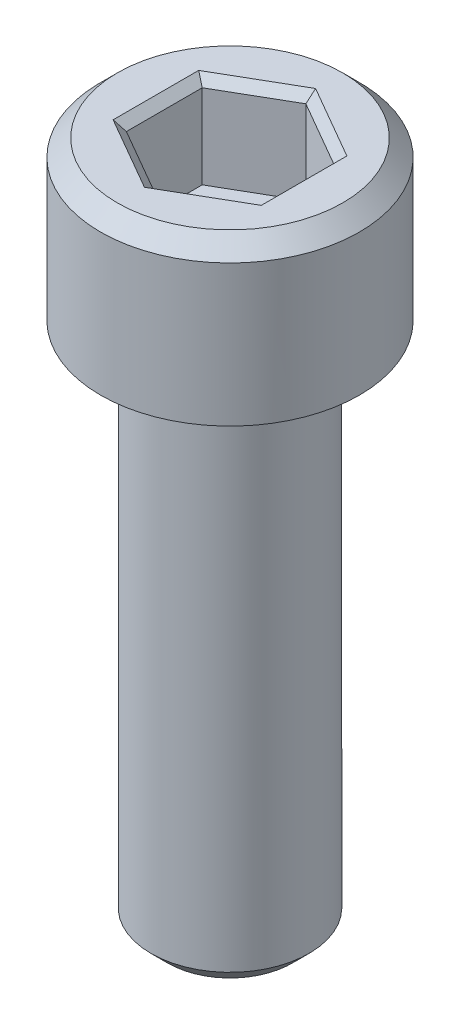
ISO-10303-21;
HEADER;
FILE_DESCRIPTION(('STEP AP214'),'2;1');
FILE_NAME('part.step','',(''),(''),'','','');
FILE_SCHEMA(('AUTOMOTIVE_DESIGN { 1 0 10303 214 1 1 1 1 }'));
ENDSEC;
DATA;
#1=APPLICATION_CONTEXT('core data for automotive mechanical design processes');
#2=APPLICATION_PROTOCOL_DEFINITION('international standard','automotive_design',2000,#1);
#3=PRODUCT_CONTEXT('',#1,'mechanical');
#4=PRODUCT('Part','Part','',(#3));
#5=PRODUCT_RELATED_PRODUCT_CATEGORY('part','',(#4));
#6=PRODUCT_DEFINITION_FORMATION('','',#4);
#7=PRODUCT_DEFINITION_CONTEXT('part definition',#1,'design');
#8=PRODUCT_DEFINITION('design','',#6,#7);
#9=PRODUCT_DEFINITION_SHAPE('','',#8);
#10=(LENGTH_UNIT() NAMED_UNIT(*) SI_UNIT(.MILLI.,.METRE.));
#11=(NAMED_UNIT(*) PLANE_ANGLE_UNIT() SI_UNIT($,.RADIAN.));
#12=(NAMED_UNIT(*) SI_UNIT($,.STERADIAN.) SOLID_ANGLE_UNIT());
#13=UNCERTAINTY_MEASURE_WITH_UNIT(LENGTH_MEASURE(1.E-05),#10,'distance_accuracy_value','');
#14=(GEOMETRIC_REPRESENTATION_CONTEXT(3) GLOBAL_UNCERTAINTY_ASSIGNED_CONTEXT((#13)) GLOBAL_UNIT_ASSIGNED_CONTEXT((#10,
#11,#12)) REPRESENTATION_CONTEXT('',''));
#15=CARTESIAN_POINT('',(0.,0.,0.));
#16=DIRECTION('',(0.,0.,1.));
#17=DIRECTION('',(1.,0.,0.));
#18=AXIS2_PLACEMENT_3D('',#15,#16,#17);
#19=CARTESIAN_POINT('',(0.,0.,0.));
#20=DIRECTION('',(0.,1.,0.));
#21=DIRECTION('',(0.,0.,1.));
#22=AXIS2_PLACEMENT_3D('',#19,#20,#21);
#23=PLANE('',#22);
#24=DIRECTION('',(0.,0.,1.));
#25=VECTOR('',#24,1.);
#26=CARTESIAN_POINT('',(2.23837500000001,0.,0.));
#27=LINE('',#26,#25);
#28=CARTESIAN_POINT('',(2.23837500000001,0.,-1.29232640879732));
#29=VERTEX_POINT('',#28);
#30=CARTESIAN_POINT('',(2.23837500000001,0.,1.29232640879733));
#31=VERTEX_POINT('',#30);
#32=EDGE_CURVE('E137',#29,#31,#27,.T.);
#33=ORIENTED_EDGE('',*,*,#32,.T.);
#34=DIRECTION('',(-0.866025403784439,0.,0.5));
#35=VECTOR('',#34,1.);
#36=CARTESIAN_POINT('',(1.11918750000001,0.,1.938489613196));
#37=LINE('',#36,#35);
#38=CARTESIAN_POINT('',(0.,0.,2.58465281759467));
#39=VERTEX_POINT('',#38);
#40=EDGE_CURVE('E139',#31,#39,#37,.T.);
#41=ORIENTED_EDGE('',*,*,#40,.T.);
#42=DIRECTION('',(-0.866025403784439,0.,-0.5));
#43=VECTOR('',#42,1.);
#44=CARTESIAN_POINT('',(-1.1191875,0.,1.938489613196));
#45=LINE('',#44,#43);
#46=CARTESIAN_POINT('',(-2.23837499999999,0.,1.29232640879733));
#47=VERTEX_POINT('',#46);
#48=EDGE_CURVE('E131',#39,#47,#45,.T.);
#49=ORIENTED_EDGE('',*,*,#48,.T.);
#50=DIRECTION('',(0.,0.,-1.));
#51=VECTOR('',#50,1.);
#52=CARTESIAN_POINT('',(-2.23837499999999,0.,0.));
#53=LINE('',#52,#51);
#54=CARTESIAN_POINT('',(-2.23837499999999,0.,-1.29232640879732));
#55=VERTEX_POINT('',#54);
#56=EDGE_CURVE('E129',#47,#55,#53,.T.);
#57=ORIENTED_EDGE('',*,*,#56,.T.);
#58=DIRECTION('',(0.866025403784438,0.,-0.5));
#59=VECTOR('',#58,1.);
#60=CARTESIAN_POINT('',(-1.11918749999999,0.,-1.93848961319599));
#61=LINE('',#60,#59);
#62=CARTESIAN_POINT('',(0.,0.,-2.58465281759465));
#63=VERTEX_POINT('',#62);
#64=EDGE_CURVE('E133',#55,#63,#61,.T.);
#65=ORIENTED_EDGE('',*,*,#64,.T.);
#66=DIRECTION('',(0.866025403784439,0.,0.5));
#67=VECTOR('',#66,1.);
#68=CARTESIAN_POINT('',(1.1191875,0.,-1.93848961319599));
#69=LINE('',#68,#67);
#70=EDGE_CURVE('E135',#63,#29,#69,.T.);
#71=ORIENTED_EDGE('',*,*,#70,.T.);
#72=EDGE_LOOP('',(#33,#41,#49,#57,#65,#71));
#73=FACE_BOUND('',#72,.T.);
#74=CARTESIAN_POINT('',(0.,0.,0.));
#75=DIRECTION('',(0.,1.,0.));
#76=DIRECTION('',(0.,0.,1.));
#77=AXIS2_PLACEMENT_3D('',#74,#75,#76);
#78=CIRCLE('',#77,3.4036);
#79=CARTESIAN_POINT('',(0.,0.,3.4036));
#80=VERTEX_POINT('',#79);
#81=EDGE_CURVE('E117',#80,#80,#78,.T.);
#82=ORIENTED_EDGE('',*,*,#81,.T.);
#83=EDGE_LOOP('',(#82));
#84=FACE_BOUND('',#83,.T.);
#85=ADVANCED_FACE('F14',(#73,#84),#23,.T.);
#86=CARTESIAN_POINT('',(0.,-4.77520000000009,0.));
#87=DIRECTION('',(0.,1.,0.));
#88=DIRECTION('',(0.,0.,1.));
#89=AXIS2_PLACEMENT_3D('',#86,#87,#88);
#90=CYLINDRICAL_SURFACE('',#89,3.9116);
#91=CARTESIAN_POINT('',(0.,-0.507999999999953,0.));
#92=DIRECTION('',(0.,1.,0.));
#93=DIRECTION('',(0.,0.,1.));
#94=AXIS2_PLACEMENT_3D('',#91,#92,#93);
#95=CIRCLE('',#94,3.9116);
#96=CARTESIAN_POINT('',(0.,-0.507999999999953,3.9116));
#97=VERTEX_POINT('',#96);
#98=EDGE_CURVE('E120',#97,#97,#95,.F.);
#99=ORIENTED_EDGE('',*,*,#98,.T.);
#100=EDGE_LOOP('',(#99));
#101=FACE_BOUND('',#100,.T.);
#102=CARTESIAN_POINT('',(0.,-4.77520000000009,0.));
#103=DIRECTION('',(0.,1.,0.));
#104=DIRECTION('',(1.,0.,0.));
#105=AXIS2_PLACEMENT_3D('',#102,#103,#104);
#106=CIRCLE('',#105,3.9116);
#107=CARTESIAN_POINT('',(3.9116,-4.77520000000009,0.));
#108=VERTEX_POINT('',#107);
#109=EDGE_CURVE('E109',#108,#108,#106,.T.);
#110=ORIENTED_EDGE('',*,*,#109,.T.);
#111=EDGE_LOOP('',(#110));
#112=FACE_BOUND('',#111,.T.);
#113=ADVANCED_FACE('F16',(#101,#112),#90,.T.);
#114=CARTESIAN_POINT('',(0.,-4.77520000000009,0.));
#115=DIRECTION('',(0.,1.,0.));
#116=DIRECTION('',(0.,0.,1.));
#117=AXIS2_PLACEMENT_3D('',#114,#115,#116);
#118=PLANE('',#117);
#119=CARTESIAN_POINT('',(0.,-4.77520000000009,0.));
#120=DIRECTION('',(0.,1.,0.));
#121=DIRECTION('',(1.,0.,0.));
#122=AXIS2_PLACEMENT_3D('',#119,#120,#121);
#123=CIRCLE('',#122,2.3876);
#124=CARTESIAN_POINT('',(2.3876,-4.77520000000009,0.));
#125=VERTEX_POINT('',#124);
#126=EDGE_CURVE('E104',#125,#125,#123,.T.);
#127=ORIENTED_EDGE('',*,*,#126,.T.);
#128=EDGE_LOOP('',(#127));
#129=FACE_BOUND('',#128,.T.);
#130=ORIENTED_EDGE('',*,*,#109,.F.);
#131=EDGE_LOOP('',(#130));
#132=FACE_BOUND('',#131,.T.);
#133=ADVANCED_FACE('F227',(#129,#132),#118,.F.);
#134=CARTESIAN_POINT('',(0.,-20.6502,0.));
#135=DIRECTION('',(0.,1.,0.));
#136=DIRECTION('',(0.,0.,1.));
#137=AXIS2_PLACEMENT_3D('',#134,#135,#136);
#138=CYLINDRICAL_SURFACE('',#137,2.3876);
#139=CARTESIAN_POINT('',(0.,-20.1422,0.));
#140=DIRECTION('',(0.,1.,0.));
#141=DIRECTION('',(0.,0.,1.));
#142=AXIS2_PLACEMENT_3D('',#139,#140,#141);
#143=CIRCLE('',#142,2.3876);
#144=CARTESIAN_POINT('',(0.,-20.1422,2.3876));
#145=VERTEX_POINT('',#144);
#146=EDGE_CURVE('E123',#145,#145,#143,.T.);
#147=ORIENTED_EDGE('',*,*,#146,.T.);
#148=EDGE_LOOP('',(#147));
#149=FACE_BOUND('',#148,.T.);
#150=ORIENTED_EDGE('',*,*,#126,.F.);
#151=EDGE_LOOP('',(#150));
#152=FACE_BOUND('',#151,.T.);
#153=ADVANCED_FACE('F230',(#149,#152),#138,.T.);
#154=CARTESIAN_POINT('',(0.,-20.6502,0.));
#155=DIRECTION('',(0.,1.,0.));
#156=DIRECTION('',(0.,0.,1.));
#157=AXIS2_PLACEMENT_3D('',#154,#155,#156);
#158=PLANE('',#157);
#159=CARTESIAN_POINT('',(0.,-20.6502,0.));
#160=DIRECTION('',(0.,1.,0.));
#161=DIRECTION('',(0.,0.,1.));
#162=AXIS2_PLACEMENT_3D('',#159,#160,#161);
#163=CIRCLE('',#162,1.8796);
#164=CARTESIAN_POINT('',(0.,-20.6502,1.8796));
#165=VERTEX_POINT('',#164);
#166=EDGE_CURVE('E126',#165,#165,#163,.F.);
#167=ORIENTED_EDGE('',*,*,#166,.T.);
#168=EDGE_LOOP('',(#167));
#169=FACE_BOUND('',#168,.T.);
#170=ADVANCED_FACE('F237',(#169),#158,.F.);
#171=CARTESIAN_POINT('',(0.,0.,0.));
#172=DIRECTION('',(0.,-1.,0.));
#173=DIRECTION('',(0.,0.,-1.));
#174=AXIS2_PLACEMENT_3D('',#171,#172,#173);
#175=CONICAL_SURFACE('',#174,3.4036,0.785398163397448);
#176=ORIENTED_EDGE('',*,*,#98,.F.);
#177=EDGE_LOOP('',(#176));
#178=FACE_BOUND('',#177,.T.);
#179=ORIENTED_EDGE('',*,*,#81,.F.);
#180=EDGE_LOOP('',(#179));
#181=FACE_BOUND('',#180,.T.);
#182=ADVANCED_FACE('F247',(#178,#181),#175,.T.);
#183=CARTESIAN_POINT('',(0.,-20.1422,0.));
#184=DIRECTION('',(0.,1.,0.));
#185=DIRECTION('',(0.,0.,1.));
#186=AXIS2_PLACEMENT_3D('',#183,#184,#185);
#187=CONICAL_SURFACE('',#186,2.3876,0.785398163397447);
#188=ORIENTED_EDGE('',*,*,#166,.F.);
#189=EDGE_LOOP('',(#188));
#190=FACE_BOUND('',#189,.T.);
#191=ORIENTED_EDGE('',*,*,#146,.F.);
#192=EDGE_LOOP('',(#191));
#193=FACE_BOUND('',#192,.T.);
#194=ADVANCED_FACE('F251',(#190,#193),#187,.T.);
#195=CARTESIAN_POINT('',(0.,-2.79399999999996,2.29135888084634));
#196=DIRECTION('',(0.5,0.,-0.866025403784438));
#197=DIRECTION('',(-0.866025403784438,0.,-0.5));
#198=AXIS2_PLACEMENT_3D('',#195,#196,#197);
#199=PLANE('',#198);
#200=DIRECTION('',(0.,1.,0.));
#201=VECTOR('',#200,1.);
#202=CARTESIAN_POINT('',(-1.984375,-2.79399999999996,1.14567944042317));
#203=LINE('',#202,#201);
#204=CARTESIAN_POINT('',(-1.984375,-2.79399999999996,1.14567944042317));
#205=VERTEX_POINT('',#204);
#206=CARTESIAN_POINT('',(-1.984375,-0.253999999999976,1.14567944042317));
#207=VERTEX_POINT('',#206);
#208=EDGE_CURVE('E97',#205,#207,#203,.T.);
#209=ORIENTED_EDGE('',*,*,#208,.T.);
#210=DIRECTION('',(0.866025403784438,0.,0.5));
#211=VECTOR('',#210,1.);
#212=CARTESIAN_POINT('',(0.,-0.253999999999976,2.29135888084634));
#213=LINE('',#212,#211);
#214=CARTESIAN_POINT('',(0.,-0.253999999999976,2.29135888084634));
#215=VERTEX_POINT('',#214);
#216=EDGE_CURVE('E22',#207,#215,#213,.T.);
#217=ORIENTED_EDGE('',*,*,#216,.T.);
#218=DIRECTION('',(0.,1.,0.));
#219=VECTOR('',#218,1.);
#220=CARTESIAN_POINT('',(0.,-2.79399999999996,2.29135888084634));
#221=LINE('',#220,#219);
#222=CARTESIAN_POINT('',(0.,-2.79399999999996,2.29135888084634));
#223=VERTEX_POINT('',#222);
#224=EDGE_CURVE('E100',#223,#215,#221,.T.);
#225=ORIENTED_EDGE('',*,*,#224,.F.);
#226=DIRECTION('',(-0.866025403784438,0.,-0.5));
#227=VECTOR('',#226,1.);
#228=CARTESIAN_POINT('',(0.,-2.79399999999996,2.29135888084634));
#229=LINE('',#228,#227);
#230=EDGE_CURVE('E90',#223,#205,#229,.T.);
#231=ORIENTED_EDGE('',*,*,#230,.T.);
#232=EDGE_LOOP('',(#209,#217,#225,#231));
#233=FACE_BOUND('',#232,.T.);
#234=ADVANCED_FACE('F96',(#233),#199,.T.);
#235=CARTESIAN_POINT('',(-1.984375,-2.79399999999996,1.14567944042317));
#236=DIRECTION('',(1.,0.,0.));
#237=DIRECTION('',(0.,0.,-1.));
#238=AXIS2_PLACEMENT_3D('',#235,#236,#237);
#239=PLANE('',#238);
#240=DIRECTION('',(0.,1.,0.));
#241=VECTOR('',#240,1.);
#242=CARTESIAN_POINT('',(-1.984375,-2.79399999999996,-1.14567944042316));
#243=LINE('',#242,#241);
#244=CARTESIAN_POINT('',(-1.984375,-2.79399999999996,-1.14567944042316));
#245=VERTEX_POINT('',#244);
#246=CARTESIAN_POINT('',(-1.984375,-0.253999999999976,-1.14567944042316));
#247=VERTEX_POINT('',#246);
#248=EDGE_CURVE('E105',#245,#247,#243,.T.);
#249=ORIENTED_EDGE('',*,*,#248,.T.);
#250=DIRECTION('',(0.,0.,1.));
#251=VECTOR('',#250,1.);
#252=CARTESIAN_POINT('',(-1.984375,-0.253999999999976,1.14567944042317));
#253=LINE('',#252,#251);
#254=EDGE_CURVE('E9',#247,#207,#253,.T.);
#255=ORIENTED_EDGE('',*,*,#254,.T.);
#256=ORIENTED_EDGE('',*,*,#208,.F.);
#257=DIRECTION('',(0.,0.,-1.));
#258=VECTOR('',#257,1.);
#259=CARTESIAN_POINT('',(-1.984375,-2.79399999999996,1.14567944042317));
#260=LINE('',#259,#258);
#261=EDGE_CURVE('E86',#205,#245,#260,.T.);
#262=ORIENTED_EDGE('',*,*,#261,.T.);
#263=EDGE_LOOP('',(#249,#255,#256,#262));
#264=FACE_BOUND('',#263,.T.);
#265=ADVANCED_FACE('F103',(#264),#239,.T.);
#266=CARTESIAN_POINT('',(-1.984375,-2.79399999999996,-1.14567944042316));
#267=DIRECTION('',(0.5,0.,0.866025403784438));
#268=DIRECTION('',(0.866025403784438,0.,-0.5));
#269=AXIS2_PLACEMENT_3D('',#266,#267,#268);
#270=PLANE('',#269);
#271=DIRECTION('',(0.,1.,0.));
#272=VECTOR('',#271,1.);
#273=CARTESIAN_POINT('',(0.,-2.79399999999996,-2.29135888084632));
#274=LINE('',#273,#272);
#275=CARTESIAN_POINT('',(0.,-2.79399999999996,-2.29135888084632));
#276=VERTEX_POINT('',#275);
#277=CARTESIAN_POINT('',(0.,-0.253999999999976,-2.29135888084632));
#278=VERTEX_POINT('',#277);
#279=EDGE_CURVE('E111',#276,#278,#274,.T.);
#280=ORIENTED_EDGE('',*,*,#279,.T.);
#281=DIRECTION('',(-0.866025403784438,0.,0.5));
#282=VECTOR('',#281,1.);
#283=CARTESIAN_POINT('',(-1.984375,-0.253999999999976,-1.14567944042316));
#284=LINE('',#283,#282);
#285=EDGE_CURVE('E35',#278,#247,#284,.T.);
#286=ORIENTED_EDGE('',*,*,#285,.T.);
#287=ORIENTED_EDGE('',*,*,#248,.F.);
#288=DIRECTION('',(0.866025403784438,0.,-0.5));
#289=VECTOR('',#288,1.);
#290=CARTESIAN_POINT('',(-1.984375,-2.79399999999996,-1.14567944042316));
#291=LINE('',#290,#289);
#292=EDGE_CURVE('E92',#245,#276,#291,.T.);
#293=ORIENTED_EDGE('',*,*,#292,.T.);
#294=EDGE_LOOP('',(#280,#286,#287,#293));
#295=FACE_BOUND('',#294,.T.);
#296=ADVANCED_FACE('F193',(#295),#270,.T.);
#297=CARTESIAN_POINT('',(0.,-2.79399999999996,-2.29135888084632));
#298=DIRECTION('',(-0.5,0.,0.866025403784438));
#299=DIRECTION('',(0.866025403784439,0.,0.5));
#300=AXIS2_PLACEMENT_3D('',#297,#298,#299);
#301=PLANE('',#300);
#302=DIRECTION('',(0.,1.,0.));
#303=VECTOR('',#302,1.);
#304=CARTESIAN_POINT('',(1.98437500000001,-2.79399999999996,-1.14567944042316));
#305=LINE('',#304,#303);
#306=CARTESIAN_POINT('',(1.98437500000001,-2.79399999999996,-1.14567944042316));
#307=VERTEX_POINT('',#306);
#308=CARTESIAN_POINT('',(1.98437500000001,-0.253999999999976,-1.14567944042316));
#309=VERTEX_POINT('',#308);
#310=EDGE_CURVE('E190',#307,#309,#305,.T.);
#311=ORIENTED_EDGE('',*,*,#310,.T.);
#312=DIRECTION('',(-0.866025403784439,0.,-0.5));
#313=VECTOR('',#312,1.);
#314=CARTESIAN_POINT('',(0.,-0.253999999999976,-2.29135888084632));
#315=LINE('',#314,#313);
#316=EDGE_CURVE('E147',#309,#278,#315,.T.);
#317=ORIENTED_EDGE('',*,*,#316,.T.);
#318=ORIENTED_EDGE('',*,*,#279,.F.);
#319=DIRECTION('',(0.866025403784439,0.,0.5));
#320=VECTOR('',#319,1.);
#321=CARTESIAN_POINT('',(0.,-2.79399999999996,-2.29135888084632));
#322=LINE('',#321,#320);
#323=EDGE_CURVE('E184',#276,#307,#322,.T.);
#324=ORIENTED_EDGE('',*,*,#323,.T.);
#325=EDGE_LOOP('',(#311,#317,#318,#324));
#326=FACE_BOUND('',#325,.T.);
#327=ADVANCED_FACE('F268',(#326),#301,.T.);
#328=CARTESIAN_POINT('',(1.98437500000001,-2.79399999999996,-1.14567944042316));
#329=DIRECTION('',(-1.,0.,0.));
#330=DIRECTION('',(0.,0.,1.));
#331=AXIS2_PLACEMENT_3D('',#328,#329,#330);
#332=PLANE('',#331);
#333=DIRECTION('',(0.,1.,0.));
#334=VECTOR('',#333,1.);
#335=CARTESIAN_POINT('',(1.98437500000001,-2.79399999999996,1.14567944042317));
#336=LINE('',#335,#334);
#337=CARTESIAN_POINT('',(1.98437500000001,-2.79399999999996,1.14567944042317));
#338=VERTEX_POINT('',#337);
#339=CARTESIAN_POINT('',(1.98437500000001,-0.253999999999976,1.14567944042317));
#340=VERTEX_POINT('',#339);
#341=EDGE_CURVE('E159',#338,#340,#336,.T.);
#342=ORIENTED_EDGE('',*,*,#341,.T.);
#343=DIRECTION('',(0.,0.,-1.));
#344=VECTOR('',#343,1.);
#345=CARTESIAN_POINT('',(1.98437500000001,-0.253999999999976,-1.14567944042316));
#346=LINE('',#345,#344);
#347=EDGE_CURVE('E145',#340,#309,#346,.T.);
#348=ORIENTED_EDGE('',*,*,#347,.T.);
#349=ORIENTED_EDGE('',*,*,#310,.F.);
#350=DIRECTION('',(0.,0.,1.));
#351=VECTOR('',#350,1.);
#352=CARTESIAN_POINT('',(1.98437500000001,-2.79399999999996,-1.14567944042316));
#353=LINE('',#352,#351);
#354=EDGE_CURVE('E186',#307,#338,#353,.T.);
#355=ORIENTED_EDGE('',*,*,#354,.T.);
#356=EDGE_LOOP('',(#342,#348,#349,#355));
#357=FACE_BOUND('',#356,.T.);
#358=ADVANCED_FACE('F271',(#357),#332,.T.);
#359=CARTESIAN_POINT('',(1.98437500000001,-2.79399999999996,1.14567944042317));
#360=DIRECTION('',(-0.5,0.,-0.866025403784438));
#361=DIRECTION('',(-0.866025403784439,0.,0.5));
#362=AXIS2_PLACEMENT_3D('',#359,#360,#361);
#363=PLANE('',#362);
#364=ORIENTED_EDGE('',*,*,#224,.T.);
#365=DIRECTION('',(0.866025403784439,0.,-0.5));
#366=VECTOR('',#365,1.);
#367=CARTESIAN_POINT('',(1.98437500000001,-0.253999999999976,1.14567944042317));
#368=LINE('',#367,#366);
#369=EDGE_CURVE('E142',#215,#340,#368,.T.);
#370=ORIENTED_EDGE('',*,*,#369,.T.);
#371=ORIENTED_EDGE('',*,*,#341,.F.);
#372=DIRECTION('',(-0.866025403784439,0.,0.5));
#373=VECTOR('',#372,1.);
#374=CARTESIAN_POINT('',(1.98437500000001,-2.79399999999996,1.14567944042317));
#375=LINE('',#374,#373);
#376=EDGE_CURVE('E158',#338,#223,#375,.T.);
#377=ORIENTED_EDGE('',*,*,#376,.T.);
#378=EDGE_LOOP('',(#364,#370,#371,#377));
#379=FACE_BOUND('',#378,.T.);
#380=ADVANCED_FACE('F155',(#379),#363,.T.);
#381=CARTESIAN_POINT('',(-3.96874999999999,-2.79399999999996,0.));
#382=DIRECTION('',(0.,-1.,0.));
#383=DIRECTION('',(0.,0.,-1.));
#384=AXIS2_PLACEMENT_3D('',#381,#382,#383);
#385=PLANE('',#384);
#386=ORIENTED_EDGE('',*,*,#230,.F.);
#387=ORIENTED_EDGE('',*,*,#376,.F.);
#388=ORIENTED_EDGE('',*,*,#354,.F.);
#389=ORIENTED_EDGE('',*,*,#323,.F.);
#390=ORIENTED_EDGE('',*,*,#292,.F.);
#391=ORIENTED_EDGE('',*,*,#261,.F.);
#392=EDGE_LOOP('',(#386,#387,#388,#389,#390,#391));
#393=FACE_BOUND('',#392,.T.);
#394=ADVANCED_FACE('F88',(#393),#385,.F.);
#395=CARTESIAN_POINT('',(-1.11918749999999,0.,-1.93848961319599));
#396=DIRECTION('',(-0.353553390593274,-0.707106781186548,-0.612372435695794));
#397=DIRECTION('',(0.,0.654653670707977,-0.755928946018455));
#398=AXIS2_PLACEMENT_3D('',#395,#396,#397);
#399=PLANE('',#398);
#400=DIRECTION('',(-0.654653670707977,0.654653670707977,-0.377964473009228));
#401=VECTOR('',#400,1.);
#402=CARTESIAN_POINT('',(-1.91860714285714,-0.319767857142939,-1.1077083503977));
#403=LINE('',#402,#401);
#404=EDGE_CURVE('E178',#247,#55,#403,.T.);
#405=ORIENTED_EDGE('',*,*,#404,.F.);
#406=ORIENTED_EDGE('',*,*,#285,.F.);
#407=DIRECTION('',(0.,0.654653670707977,-0.755928946018455));
#408=VECTOR('',#407,1.);
#409=CARTESIAN_POINT('',(0.,-0.319767857142939,-2.21541670079541));
#410=LINE('',#409,#408);
#411=EDGE_CURVE('E101',#63,#278,#410,.F.);
#412=ORIENTED_EDGE('',*,*,#411,.F.);
#413=ORIENTED_EDGE('',*,*,#64,.F.);
#414=EDGE_LOOP('',(#405,#406,#412,#413));
#415=FACE_BOUND('',#414,.T.);
#416=ADVANCED_FACE('F198',(#415),#399,.F.);
#417=CARTESIAN_POINT('',(1.1191875,0.,-1.93848961319599));
#418=DIRECTION('',(0.353553390593274,-0.707106781186548,-0.612372435695794));
#419=DIRECTION('',(0.,0.654653670707977,-0.755928946018455));
#420=AXIS2_PLACEMENT_3D('',#417,#418,#419);
#421=PLANE('',#420);
#422=ORIENTED_EDGE('',*,*,#411,.T.);
#423=ORIENTED_EDGE('',*,*,#316,.F.);
#424=DIRECTION('',(0.654653670707977,0.654653670707977,-0.377964473009228));
#425=VECTOR('',#424,1.);
#426=CARTESIAN_POINT('',(1.91860714285715,-0.319767857142939,-1.1077083503977));
#427=LINE('',#426,#425);
#428=EDGE_CURVE('E175',#29,#309,#427,.F.);
#429=ORIENTED_EDGE('',*,*,#428,.F.);
#430=ORIENTED_EDGE('',*,*,#70,.F.);
#431=EDGE_LOOP('',(#422,#423,#429,#430));
#432=FACE_BOUND('',#431,.T.);
#433=ADVANCED_FACE('F203',(#432),#421,.F.);
#434=CARTESIAN_POINT('',(-2.23837499999999,0.,0.));
#435=DIRECTION('',(-0.707106781186548,-0.707106781186548,0.));
#436=DIRECTION('',(0.707106781186548,-0.707106781186548,0.));
#437=AXIS2_PLACEMENT_3D('',#434,#435,#436);
#438=PLANE('',#437);
#439=ORIENTED_EDGE('',*,*,#404,.T.);
#440=ORIENTED_EDGE('',*,*,#56,.F.);
#441=DIRECTION('',(0.654653670707977,-0.654653670707977,-0.377964473009227));
#442=VECTOR('',#441,1.);
#443=CARTESIAN_POINT('',(-1.91860714285714,-0.319767857142939,1.10770835039772));
#444=LINE('',#443,#442);
#445=EDGE_CURVE('E171',#207,#47,#444,.F.);
#446=ORIENTED_EDGE('',*,*,#445,.F.);
#447=ORIENTED_EDGE('',*,*,#254,.F.);
#448=EDGE_LOOP('',(#439,#440,#446,#447));
#449=FACE_BOUND('',#448,.T.);
#450=ADVANCED_FACE('F210',(#449),#438,.F.);
#451=CARTESIAN_POINT('',(2.23837500000001,0.,0.));
#452=DIRECTION('',(0.707106781186548,-0.707106781186548,0.));
#453=DIRECTION('',(0.707106781186548,0.707106781186548,0.));
#454=AXIS2_PLACEMENT_3D('',#451,#452,#453);
#455=PLANE('',#454);
#456=ORIENTED_EDGE('',*,*,#428,.T.);
#457=ORIENTED_EDGE('',*,*,#347,.F.);
#458=DIRECTION('',(0.654653670707977,0.654653670707977,0.377964473009229));
#459=VECTOR('',#458,1.);
#460=CARTESIAN_POINT('',(1.91860714285715,-0.319767857142939,1.10770835039772));
#461=LINE('',#460,#459);
#462=EDGE_CURVE('E167',#31,#340,#461,.F.);
#463=ORIENTED_EDGE('',*,*,#462,.F.);
#464=ORIENTED_EDGE('',*,*,#32,.F.);
#465=EDGE_LOOP('',(#456,#457,#463,#464));
#466=FACE_BOUND('',#465,.T.);
#467=ADVANCED_FACE('F212',(#466),#455,.F.);
#468=CARTESIAN_POINT('',(-1.1191875,0.,1.938489613196));
#469=DIRECTION('',(-0.353553390593274,-0.707106781186548,0.612372435695794));
#470=DIRECTION('',(0.,-0.654653670707977,-0.755928946018455));
#471=AXIS2_PLACEMENT_3D('',#468,#469,#470);
#472=PLANE('',#471);
#473=ORIENTED_EDGE('',*,*,#445,.T.);
#474=ORIENTED_EDGE('',*,*,#48,.F.);
#475=DIRECTION('',(0.,-0.654653670707977,-0.755928946018455));
#476=VECTOR('',#475,1.);
#477=CARTESIAN_POINT('',(0.,-0.319767857142939,2.21541670079543));
#478=LINE('',#477,#476);
#479=EDGE_CURVE('E164',#215,#39,#478,.F.);
#480=ORIENTED_EDGE('',*,*,#479,.F.);
#481=ORIENTED_EDGE('',*,*,#216,.F.);
#482=EDGE_LOOP('',(#473,#474,#480,#481));
#483=FACE_BOUND('',#482,.T.);
#484=ADVANCED_FACE('F169',(#483),#472,.F.);
#485=CARTESIAN_POINT('',(1.11918750000001,0.,1.938489613196));
#486=DIRECTION('',(0.353553390593274,-0.707106781186548,0.612372435695794));
#487=DIRECTION('',(0.,-0.654653670707976,-0.755928946018455));
#488=AXIS2_PLACEMENT_3D('',#485,#486,#487);
#489=PLANE('',#488);
#490=ORIENTED_EDGE('',*,*,#462,.T.);
#491=ORIENTED_EDGE('',*,*,#369,.F.);
#492=ORIENTED_EDGE('',*,*,#479,.T.);
#493=ORIENTED_EDGE('',*,*,#40,.F.);
#494=EDGE_LOOP('',(#490,#491,#492,#493));
#495=FACE_BOUND('',#494,.T.);
#496=ADVANCED_FACE('F162',(#495),#489,.F.);
#497=CLOSED_SHELL('',(#85,#113,#133,#153,#170,#182,#194,#234,#265,#296,#327,#358,#380,#394,#416,
#433,#450,#467,#484,#496));
#498=MANIFOLD_SOLID_BREP('B1',#497);
#499=ADVANCED_BREP_SHAPE_REPRESENTATION('',(#18,#498),#14);
#500=SHAPE_DEFINITION_REPRESENTATION(#9,#499);
ENDSEC;
END-ISO-10303-21;
